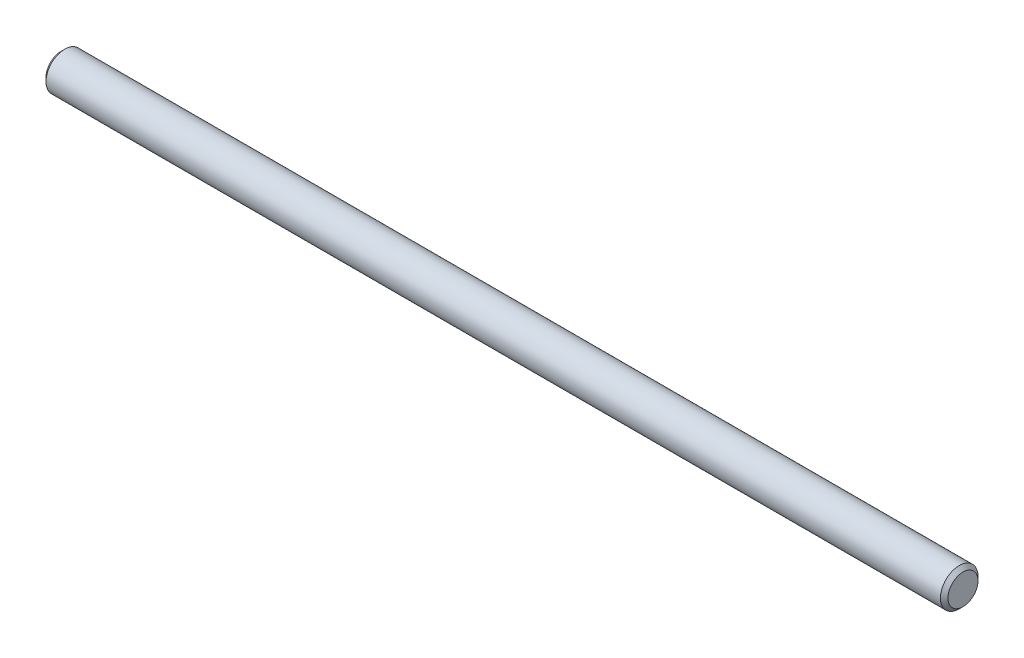
ISO-10303-21;
HEADER;
FILE_DESCRIPTION(('STEP AP214'),'2;1');
FILE_NAME('part.step','',(''),(''),'','','');
FILE_SCHEMA(('AUTOMOTIVE_DESIGN { 1 0 10303 214 1 1 1 1 }'));
ENDSEC;
DATA;
#1=APPLICATION_CONTEXT('core data for automotive mechanical design processes');
#2=APPLICATION_PROTOCOL_DEFINITION('international standard','automotive_design',2000,#1);
#3=PRODUCT_CONTEXT('',#1,'mechanical');
#4=PRODUCT('Part','Part','',(#3));
#5=PRODUCT_RELATED_PRODUCT_CATEGORY('part','',(#4));
#6=PRODUCT_DEFINITION_FORMATION('','',#4);
#7=PRODUCT_DEFINITION_CONTEXT('part definition',#1,'design');
#8=PRODUCT_DEFINITION('design','',#6,#7);
#9=PRODUCT_DEFINITION_SHAPE('','',#8);
#10=(LENGTH_UNIT() NAMED_UNIT(*) SI_UNIT(.MILLI.,.METRE.));
#11=(NAMED_UNIT(*) PLANE_ANGLE_UNIT() SI_UNIT($,.RADIAN.));
#12=(NAMED_UNIT(*) SI_UNIT($,.STERADIAN.) SOLID_ANGLE_UNIT());
#13=UNCERTAINTY_MEASURE_WITH_UNIT(LENGTH_MEASURE(1.E-05),#10,'distance_accuracy_value','');
#14=(GEOMETRIC_REPRESENTATION_CONTEXT(3) GLOBAL_UNCERTAINTY_ASSIGNED_CONTEXT((#13)) GLOBAL_UNIT_ASSIGNED_CONTEXT((#10,
#11,#12)) REPRESENTATION_CONTEXT('',''));
#15=CARTESIAN_POINT('',(0.,0.,0.));
#16=DIRECTION('',(0.,0.,1.));
#17=DIRECTION('',(1.,0.,0.));
#18=AXIS2_PLACEMENT_3D('',#15,#16,#17);
#19=CARTESIAN_POINT('',(-19.05,0.,0.));
#20=DIRECTION('',(1.,0.,0.));
#21=DIRECTION('',(0.,0.,-1.));
#22=AXIS2_PLACEMENT_3D('',#19,#20,#21);
#23=CYLINDRICAL_SURFACE('',#22,0.79375);
#24=CARTESIAN_POINT('',(18.89125,0.,0.));
#25=DIRECTION('',(1.,0.,0.));
#26=DIRECTION('',(0.,0.,-1.));
#27=AXIS2_PLACEMENT_3D('',#24,#25,#26);
#28=CIRCLE('',#27,0.79375);
#29=CARTESIAN_POINT('',(18.89125,0.,-0.79375));
#30=VERTEX_POINT('',#29);
#31=EDGE_CURVE('E42',#30,#30,#28,.F.);
#32=ORIENTED_EDGE('',*,*,#31,.T.);
#33=EDGE_LOOP('',(#32));
#34=FACE_BOUND('',#33,.T.);
#35=CARTESIAN_POINT('',(-18.89125,0.,0.));
#36=DIRECTION('',(1.,0.,0.));
#37=DIRECTION('',(0.,0.,-1.));
#38=AXIS2_PLACEMENT_3D('',#35,#36,#37);
#39=CIRCLE('',#38,0.79375);
#40=CARTESIAN_POINT('',(-18.89125,0.,-0.79375));
#41=VERTEX_POINT('',#40);
#42=EDGE_CURVE('E46',#41,#41,#39,.T.);
#43=ORIENTED_EDGE('',*,*,#42,.T.);
#44=EDGE_LOOP('',(#43));
#45=FACE_BOUND('',#44,.T.);
#46=ADVANCED_FACE('F35',(#34,#45),#23,.T.);
#47=CARTESIAN_POINT('',(-19.05,0.,0.));
#48=DIRECTION('',(1.,0.,0.));
#49=DIRECTION('',(0.,0.,-1.));
#50=AXIS2_PLACEMENT_3D('',#47,#48,#49);
#51=PLANE('',#50);
#52=CARTESIAN_POINT('',(-19.05,0.,0.));
#53=DIRECTION('',(1.,0.,0.));
#54=DIRECTION('',(0.,0.,-1.));
#55=AXIS2_PLACEMENT_3D('',#52,#53,#54);
#56=CIRCLE('',#55,0.63499999999999);
#57=CARTESIAN_POINT('',(-19.05,0.,-0.63499999999999));
#58=VERTEX_POINT('',#57);
#59=EDGE_CURVE('E10',#58,#58,#56,.F.);
#60=ORIENTED_EDGE('',*,*,#59,.T.);
#61=EDGE_LOOP('',(#60));
#62=FACE_BOUND('',#61,.T.);
#63=ADVANCED_FACE('F66',(#62),#51,.F.);
#64=CARTESIAN_POINT('',(19.05,0.,0.));
#65=DIRECTION('',(1.,0.,0.));
#66=DIRECTION('',(0.,0.,-1.));
#67=AXIS2_PLACEMENT_3D('',#64,#65,#66);
#68=PLANE('',#67);
#69=CARTESIAN_POINT('',(19.05,0.,0.));
#70=DIRECTION('',(1.,0.,0.));
#71=DIRECTION('',(0.,0.,-1.));
#72=AXIS2_PLACEMENT_3D('',#69,#70,#71);
#73=CIRCLE('',#72,0.635000000000003);
#74=CARTESIAN_POINT('',(19.05,0.,-0.635000000000003));
#75=VERTEX_POINT('',#74);
#76=EDGE_CURVE('E50',#75,#75,#73,.T.);
#77=ORIENTED_EDGE('',*,*,#76,.T.);
#78=EDGE_LOOP('',(#77));
#79=FACE_BOUND('',#78,.T.);
#80=ADVANCED_FACE('F56',(#79),#68,.T.);
#81=CARTESIAN_POINT('',(19.05,0.,0.));
#82=DIRECTION('',(-1.,0.,0.));
#83=DIRECTION('',(0.,0.,1.));
#84=AXIS2_PLACEMENT_3D('',#81,#82,#83);
#85=CONICAL_SURFACE('',#84,0.635000000000003,0.785398163397462);
#86=ORIENTED_EDGE('',*,*,#31,.F.);
#87=EDGE_LOOP('',(#86));
#88=FACE_BOUND('',#87,.T.);
#89=ORIENTED_EDGE('',*,*,#76,.F.);
#90=EDGE_LOOP('',(#89));
#91=FACE_BOUND('',#90,.T.);
#92=ADVANCED_FACE('F58',(#88,#91),#85,.T.);
#93=CARTESIAN_POINT('',(-18.89125,0.,0.));
#94=DIRECTION('',(1.,0.,0.));
#95=DIRECTION('',(0.,0.,-1.));
#96=AXIS2_PLACEMENT_3D('',#93,#94,#95);
#97=CONICAL_SURFACE('',#96,0.79375,0.78539816339744);
#98=ORIENTED_EDGE('',*,*,#59,.F.);
#99=EDGE_LOOP('',(#98));
#100=FACE_BOUND('',#99,.T.);
#101=ORIENTED_EDGE('',*,*,#42,.F.);
#102=EDGE_LOOP('',(#101));
#103=FACE_BOUND('',#102,.T.);
#104=ADVANCED_FACE('F37',(#100,#103),#97,.T.);
#105=CLOSED_SHELL('',(#46,#63,#80,#92,#104));
#106=MANIFOLD_SOLID_BREP('B2',#105);
#107=ADVANCED_BREP_SHAPE_REPRESENTATION('',(#18,#106),#14);
#108=SHAPE_DEFINITION_REPRESENTATION(#9,#107);
ENDSEC;
END-ISO-10303-21;
